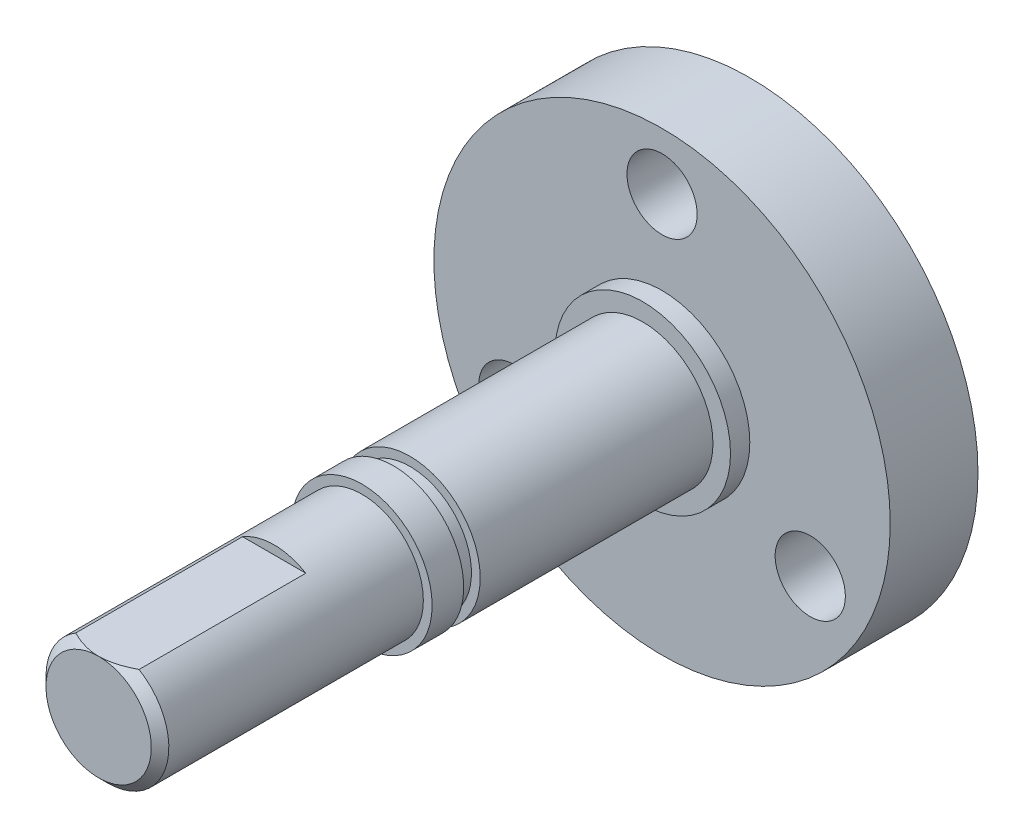
ISO-10303-21;
HEADER;
FILE_DESCRIPTION(('STEP AP214'),'2;1');
FILE_NAME('part.step','',(''),(''),'','','');
FILE_SCHEMA(('AUTOMOTIVE_DESIGN { 1 0 10303 214 1 1 1 1 }'));
ENDSEC;
DATA;
#1=APPLICATION_CONTEXT('core data for automotive mechanical design processes');
#2=APPLICATION_PROTOCOL_DEFINITION('international standard','automotive_design',2000,#1);
#3=PRODUCT_CONTEXT('',#1,'mechanical');
#4=PRODUCT('Part','Part','',(#3));
#5=PRODUCT_RELATED_PRODUCT_CATEGORY('part','',(#4));
#6=PRODUCT_DEFINITION_FORMATION('','',#4);
#7=PRODUCT_DEFINITION_CONTEXT('part definition',#1,'design');
#8=PRODUCT_DEFINITION('design','',#6,#7);
#9=PRODUCT_DEFINITION_SHAPE('','',#8);
#10=(LENGTH_UNIT() NAMED_UNIT(*) SI_UNIT(.MILLI.,.METRE.));
#11=(NAMED_UNIT(*) PLANE_ANGLE_UNIT() SI_UNIT($,.RADIAN.));
#12=(NAMED_UNIT(*) SI_UNIT($,.STERADIAN.) SOLID_ANGLE_UNIT());
#13=UNCERTAINTY_MEASURE_WITH_UNIT(LENGTH_MEASURE(1.E-05),#10,'distance_accuracy_value','');
#14=(GEOMETRIC_REPRESENTATION_CONTEXT(3) GLOBAL_UNCERTAINTY_ASSIGNED_CONTEXT((#13)) GLOBAL_UNIT_ASSIGNED_CONTEXT((#10,
#11,#12)) REPRESENTATION_CONTEXT('',''));
#15=CARTESIAN_POINT('',(0.,0.,0.));
#16=DIRECTION('',(0.,0.,1.));
#17=DIRECTION('',(1.,0.,0.));
#18=AXIS2_PLACEMENT_3D('',#15,#16,#17);
#19=CARTESIAN_POINT('',(0.,0.,22.1));
#20=DIRECTION('',(0.,0.,-1.));
#21=DIRECTION('',(-1.,0.,0.));
#22=AXIS2_PLACEMENT_3D('',#19,#20,#21);
#23=CYLINDRICAL_SURFACE('',#22,4.);
#24=CARTESIAN_POINT('',(0.,0.,6.1));
#25=DIRECTION('',(0.,0.,1.));
#26=DIRECTION('',(1.,0.,0.));
#27=AXIS2_PLACEMENT_3D('',#24,#25,#26);
#28=CIRCLE('',#27,4.);
#29=CARTESIAN_POINT('',(4.,0.,6.1));
#30=VERTEX_POINT('',#29);
#31=EDGE_CURVE('E114',#30,#30,#28,.T.);
#32=ORIENTED_EDGE('',*,*,#31,.T.);
#33=EDGE_LOOP('',(#32));
#34=FACE_BOUND('',#33,.T.);
#35=CARTESIAN_POINT('',(0.,0.,19.36));
#36=DIRECTION('',(0.,0.,1.));
#37=DIRECTION('',(1.,0.,0.));
#38=AXIS2_PLACEMENT_3D('',#35,#36,#37);
#39=CIRCLE('',#38,4.);
#40=CARTESIAN_POINT('',(4.,0.,19.36));
#41=VERTEX_POINT('',#40);
#42=EDGE_CURVE('E91',#41,#41,#39,.T.);
#43=ORIENTED_EDGE('',*,*,#42,.F.);
#44=EDGE_LOOP('',(#43));
#45=FACE_BOUND('',#44,.T.);
#46=ADVANCED_FACE('F33',(#34,#45),#23,.T.);
#47=CARTESIAN_POINT('',(0.,0.,6.1));
#48=DIRECTION('',(0.,0.,1.));
#49=DIRECTION('',(1.,0.,0.));
#50=AXIS2_PLACEMENT_3D('',#47,#48,#49);
#51=PLANE('',#50);
#52=CARTESIAN_POINT('',(0.,0.,6.1));
#53=DIRECTION('',(0.,0.,1.));
#54=DIRECTION('',(1.,0.,0.));
#55=AXIS2_PLACEMENT_3D('',#52,#53,#54);
#56=CIRCLE('',#55,5.);
#57=CARTESIAN_POINT('',(5.,0.,6.1));
#58=VERTEX_POINT('',#57);
#59=EDGE_CURVE('E123',#58,#58,#56,.T.);
#60=ORIENTED_EDGE('',*,*,#59,.T.);
#61=EDGE_LOOP('',(#60));
#62=FACE_BOUND('',#61,.T.);
#63=ORIENTED_EDGE('',*,*,#31,.F.);
#64=EDGE_LOOP('',(#63));
#65=FACE_BOUND('',#64,.T.);
#66=ADVANCED_FACE('F155',(#62,#65),#51,.T.);
#67=CARTESIAN_POINT('',(0.,0.,5.));
#68=DIRECTION('',(0.,0.,1.));
#69=DIRECTION('',(1.,0.,0.));
#70=AXIS2_PLACEMENT_3D('',#67,#68,#69);
#71=PLANE('',#70);
#72=CARTESIAN_POINT('',(-8.44374768689832,-4.87499999999992,5.));
#73=DIRECTION('',(0.,0.,1.));
#74=DIRECTION('',(-0.499999999999992,0.866025403784443,0.));
#75=AXIS2_PLACEMENT_3D('',#72,#73,#74);
#76=CIRCLE('',#75,2.);
#77=CARTESIAN_POINT('',(-9.4437476868983,-3.14294919243104,5.));
#78=VERTEX_POINT('',#77);
#79=EDGE_CURVE('E92',#78,#78,#76,.T.);
#80=ORIENTED_EDGE('',*,*,#79,.F.);
#81=EDGE_LOOP('',(#80));
#82=FACE_BOUND('',#81,.T.);
#83=CARTESIAN_POINT('',(8.44374768689825,-4.87500000000004,5.));
#84=DIRECTION('',(0.,0.,1.));
#85=DIRECTION('',(-0.500000000000004,-0.866025403784436,0.));
#86=AXIS2_PLACEMENT_3D('',#83,#84,#85);
#87=CIRCLE('',#86,2.);
#88=CARTESIAN_POINT('',(7.44374768689825,-6.60705080756891,5.));
#89=VERTEX_POINT('',#88);
#90=EDGE_CURVE('E99',#89,#89,#87,.T.);
#91=ORIENTED_EDGE('',*,*,#90,.F.);
#92=EDGE_LOOP('',(#91));
#93=FACE_BOUND('',#92,.T.);
#94=CARTESIAN_POINT('',(0.,9.75,5.));
#95=DIRECTION('',(0.,0.,1.));
#96=DIRECTION('',(1.,0.,0.));
#97=AXIS2_PLACEMENT_3D('',#94,#95,#96);
#98=CIRCLE('',#97,2.);
#99=CARTESIAN_POINT('',(2.,9.75,5.));
#100=VERTEX_POINT('',#99);
#101=EDGE_CURVE('E105',#100,#100,#98,.T.);
#102=ORIENTED_EDGE('',*,*,#101,.F.);
#103=EDGE_LOOP('',(#102));
#104=FACE_BOUND('',#103,.T.);
#105=CARTESIAN_POINT('',(0.,0.,5.));
#106=DIRECTION('',(0.,0.,1.));
#107=DIRECTION('',(1.,0.,0.));
#108=AXIS2_PLACEMENT_3D('',#105,#106,#107);
#109=CIRCLE('',#108,13.);
#110=CARTESIAN_POINT('',(13.,0.,5.));
#111=VERTEX_POINT('',#110);
#112=EDGE_CURVE('E129',#111,#111,#109,.T.);
#113=ORIENTED_EDGE('',*,*,#112,.T.);
#114=EDGE_LOOP('',(#113));
#115=FACE_BOUND('',#114,.T.);
#116=CARTESIAN_POINT('',(0.,0.,5.));
#117=DIRECTION('',(0.,0.,1.));
#118=DIRECTION('',(1.,0.,0.));
#119=AXIS2_PLACEMENT_3D('',#116,#117,#118);
#120=CIRCLE('',#119,5.);
#121=CARTESIAN_POINT('',(5.,0.,5.));
#122=VERTEX_POINT('',#121);
#123=EDGE_CURVE('E120',#122,#122,#120,.T.);
#124=ORIENTED_EDGE('',*,*,#123,.F.);
#125=EDGE_LOOP('',(#124));
#126=FACE_BOUND('',#125,.T.);
#127=ADVANCED_FACE('F160',(#82,#93,#104,#115,#126),#71,.T.);
#128=CARTESIAN_POINT('',(0.,0.,5.));
#129=DIRECTION('',(0.,0.,-1.));
#130=DIRECTION('',(-1.,0.,0.));
#131=AXIS2_PLACEMENT_3D('',#128,#129,#130);
#132=CYLINDRICAL_SURFACE('',#131,13.);
#133=ORIENTED_EDGE('',*,*,#112,.F.);
#134=EDGE_LOOP('',(#133));
#135=FACE_BOUND('',#134,.T.);
#136=CARTESIAN_POINT('',(0.,0.,0.));
#137=DIRECTION('',(0.,0.,1.));
#138=DIRECTION('',(1.,0.,0.));
#139=AXIS2_PLACEMENT_3D('',#136,#137,#138);
#140=CIRCLE('',#139,13.);
#141=CARTESIAN_POINT('',(13.,0.,0.));
#142=VERTEX_POINT('',#141);
#143=EDGE_CURVE('E126',#142,#142,#140,.T.);
#144=ORIENTED_EDGE('',*,*,#143,.T.);
#145=EDGE_LOOP('',(#144));
#146=FACE_BOUND('',#145,.T.);
#147=ADVANCED_FACE('F35',(#135,#146),#132,.T.);
#148=CARTESIAN_POINT('',(0.,0.,0.));
#149=DIRECTION('',(0.,0.,1.));
#150=DIRECTION('',(1.,0.,0.));
#151=AXIS2_PLACEMENT_3D('',#148,#149,#150);
#152=PLANE('',#151);
#153=CARTESIAN_POINT('',(0.,0.,0.));
#154=DIRECTION('',(0.,0.,-1.));
#155=DIRECTION('',(-1.,0.,0.));
#156=AXIS2_PLACEMENT_3D('',#153,#154,#155);
#157=CIRCLE('',#156,6.);
#158=CARTESIAN_POINT('',(-6.,0.,0.));
#159=VERTEX_POINT('',#158);
#160=EDGE_CURVE('E313',#159,#159,#157,.T.);
#161=ORIENTED_EDGE('',*,*,#160,.F.);
#162=EDGE_LOOP('',(#161));
#163=FACE_BOUND('',#162,.T.);
#164=CARTESIAN_POINT('',(-8.44374768689832,-4.87499999999992,0.));
#165=DIRECTION('',(0.,0.,1.));
#166=DIRECTION('',(-0.499999999999992,0.866025403784443,0.));
#167=AXIS2_PLACEMENT_3D('',#164,#165,#166);
#168=CIRCLE('',#167,2.);
#169=CARTESIAN_POINT('',(-9.4437476868983,-3.14294919243104,0.));
#170=VERTEX_POINT('',#169);
#171=EDGE_CURVE('E95',#170,#170,#168,.T.);
#172=ORIENTED_EDGE('',*,*,#171,.T.);
#173=EDGE_LOOP('',(#172));
#174=FACE_BOUND('',#173,.T.);
#175=CARTESIAN_POINT('',(8.44374768689825,-4.87500000000004,0.));
#176=DIRECTION('',(0.,0.,1.));
#177=DIRECTION('',(-0.500000000000004,-0.866025403784436,0.));
#178=AXIS2_PLACEMENT_3D('',#175,#176,#177);
#179=CIRCLE('',#178,2.);
#180=CARTESIAN_POINT('',(7.44374768689825,-6.60705080756891,0.));
#181=VERTEX_POINT('',#180);
#182=EDGE_CURVE('E102',#181,#181,#179,.T.);
#183=ORIENTED_EDGE('',*,*,#182,.T.);
#184=EDGE_LOOP('',(#183));
#185=FACE_BOUND('',#184,.T.);
#186=CARTESIAN_POINT('',(0.,9.75,0.));
#187=DIRECTION('',(0.,0.,1.));
#188=DIRECTION('',(1.,0.,0.));
#189=AXIS2_PLACEMENT_3D('',#186,#187,#188);
#190=CIRCLE('',#189,2.);
#191=CARTESIAN_POINT('',(2.,9.75,0.));
#192=VERTEX_POINT('',#191);
#193=EDGE_CURVE('E108',#192,#192,#190,.T.);
#194=ORIENTED_EDGE('',*,*,#193,.T.);
#195=EDGE_LOOP('',(#194));
#196=FACE_BOUND('',#195,.T.);
#197=ORIENTED_EDGE('',*,*,#143,.F.);
#198=EDGE_LOOP('',(#197));
#199=FACE_BOUND('',#198,.T.);
#200=ADVANCED_FACE('F171',(#163,#174,#185,#196,#199),#152,.F.);
#201=CARTESIAN_POINT('',(0.,0.,6.1));
#202=DIRECTION('',(0.,0.,-1.));
#203=DIRECTION('',(-1.,0.,0.));
#204=AXIS2_PLACEMENT_3D('',#201,#202,#203);
#205=CYLINDRICAL_SURFACE('',#204,5.);
#206=ORIENTED_EDGE('',*,*,#59,.F.);
#207=EDGE_LOOP('',(#206));
#208=FACE_BOUND('',#207,.T.);
#209=ORIENTED_EDGE('',*,*,#123,.T.);
#210=EDGE_LOOP('',(#209));
#211=FACE_BOUND('',#210,.T.);
#212=ADVANCED_FACE('F167',(#208,#211),#205,.T.);
#213=CARTESIAN_POINT('',(0.,9.75,0.));
#214=DIRECTION('',(0.,0.,1.));
#215=DIRECTION('',(1.,0.,0.));
#216=AXIS2_PLACEMENT_3D('',#213,#214,#215);
#217=CYLINDRICAL_SURFACE('',#216,2.);
#218=ORIENTED_EDGE('',*,*,#193,.F.);
#219=EDGE_LOOP('',(#218));
#220=FACE_BOUND('',#219,.T.);
#221=ORIENTED_EDGE('',*,*,#101,.T.);
#222=EDGE_LOOP('',(#221));
#223=FACE_BOUND('',#222,.T.);
#224=ADVANCED_FACE('F170',(#220,#223),#217,.F.);
#225=CARTESIAN_POINT('',(8.44374768689825,-4.87500000000004,0.));
#226=DIRECTION('',(0.,0.,1.));
#227=DIRECTION('',(1.,0.,0.));
#228=AXIS2_PLACEMENT_3D('',#225,#226,#227);
#229=CYLINDRICAL_SURFACE('',#228,2.);
#230=ORIENTED_EDGE('',*,*,#182,.F.);
#231=EDGE_LOOP('',(#230));
#232=FACE_BOUND('',#231,.T.);
#233=ORIENTED_EDGE('',*,*,#90,.T.);
#234=EDGE_LOOP('',(#233));
#235=FACE_BOUND('',#234,.T.);
#236=ADVANCED_FACE('F196',(#232,#235),#229,.F.);
#237=CARTESIAN_POINT('',(-8.44374768689832,-4.87499999999992,0.));
#238=DIRECTION('',(0.,0.,1.));
#239=DIRECTION('',(1.,0.,0.));
#240=AXIS2_PLACEMENT_3D('',#237,#238,#239);
#241=CYLINDRICAL_SURFACE('',#240,2.);
#242=ORIENTED_EDGE('',*,*,#171,.F.);
#243=EDGE_LOOP('',(#242));
#244=FACE_BOUND('',#243,.T.);
#245=ORIENTED_EDGE('',*,*,#79,.T.);
#246=EDGE_LOOP('',(#245));
#247=FACE_BOUND('',#246,.T.);
#248=ADVANCED_FACE('F202',(#244,#247),#241,.F.);
#249=CARTESIAN_POINT('',(3.5,0.,20.3));
#250=DIRECTION('',(0.,0.,-1.));
#251=DIRECTION('',(-1.,0.,0.));
#252=AXIS2_PLACEMENT_3D('',#249,#250,#251);
#253=PLANE('',#252);
#254=CARTESIAN_POINT('',(0.,0.,20.3));
#255=DIRECTION('',(0.,0.,-1.));
#256=DIRECTION('',(-1.,0.,0.));
#257=AXIS2_PLACEMENT_3D('',#254,#255,#256);
#258=CIRCLE('',#257,3.5);
#259=CARTESIAN_POINT('',(-3.5,0.,20.3));
#260=VERTEX_POINT('',#259);
#261=EDGE_CURVE('E88',#260,#260,#258,.T.);
#262=ORIENTED_EDGE('',*,*,#261,.F.);
#263=EDGE_LOOP('',(#262));
#264=FACE_BOUND('',#263,.T.);
#265=CARTESIAN_POINT('',(0.,0.,20.3));
#266=DIRECTION('',(0.,0.,-1.));
#267=DIRECTION('',(-1.,0.,0.));
#268=AXIS2_PLACEMENT_3D('',#265,#266,#267);
#269=CIRCLE('',#268,4.);
#270=CARTESIAN_POINT('',(-4.,0.,20.3));
#271=VERTEX_POINT('',#270);
#272=EDGE_CURVE('E96',#271,#271,#269,.T.);
#273=ORIENTED_EDGE('',*,*,#272,.T.);
#274=EDGE_LOOP('',(#273));
#275=FACE_BOUND('',#274,.T.);
#276=ADVANCED_FACE('F223',(#264,#275),#253,.T.);
#277=CARTESIAN_POINT('',(3.5,0.,19.36));
#278=DIRECTION('',(0.,0.,1.));
#279=DIRECTION('',(1.,0.,0.));
#280=AXIS2_PLACEMENT_3D('',#277,#278,#279);
#281=PLANE('',#280);
#282=CARTESIAN_POINT('',(0.,0.,19.36));
#283=DIRECTION('',(0.,0.,-1.));
#284=DIRECTION('',(-1.,0.,0.));
#285=AXIS2_PLACEMENT_3D('',#282,#283,#284);
#286=CIRCLE('',#285,3.5);
#287=CARTESIAN_POINT('',(-3.5,0.,19.36));
#288=VERTEX_POINT('',#287);
#289=EDGE_CURVE('E83',#288,#288,#286,.T.);
#290=ORIENTED_EDGE('',*,*,#289,.T.);
#291=EDGE_LOOP('',(#290));
#292=FACE_BOUND('',#291,.T.);
#293=ORIENTED_EDGE('',*,*,#42,.T.);
#294=EDGE_LOOP('',(#293));
#295=FACE_BOUND('',#294,.T.);
#296=ADVANCED_FACE('F225',(#292,#295),#281,.T.);
#297=CARTESIAN_POINT('',(0.,0.,28.7718328466138));
#298=DIRECTION('',(0.,0.,-1.));
#299=DIRECTION('',(-1.,0.,0.));
#300=AXIS2_PLACEMENT_3D('',#297,#298,#299);
#301=CYLINDRICAL_SURFACE('',#300,3.5);
#302=ORIENTED_EDGE('',*,*,#261,.T.);
#303=EDGE_LOOP('',(#302));
#304=FACE_BOUND('',#303,.T.);
#305=ORIENTED_EDGE('',*,*,#289,.F.);
#306=EDGE_LOOP('',(#305));
#307=FACE_BOUND('',#306,.T.);
#308=ADVANCED_FACE('F209',(#304,#307),#301,.T.);
#309=CARTESIAN_POINT('',(0.,0.,37.1));
#310=DIRECTION('',(0.,0.,1.));
#311=DIRECTION('',(1.,0.,0.));
#312=AXIS2_PLACEMENT_3D('',#309,#310,#311);
#313=PLANE('',#312);
#314=CARTESIAN_POINT('',(0.,0.,37.1));
#315=DIRECTION('',(0.,0.,1.));
#316=DIRECTION('',(1.,0.,0.));
#317=AXIS2_PLACEMENT_3D('',#314,#315,#316);
#318=CIRCLE('',#317,2.99999999999999);
#319=CARTESIAN_POINT('',(0.,2.99999999999999,37.1));
#320=VERTEX_POINT('',#319);
#321=EDGE_CURVE('E132',#320,#320,#318,.T.);
#322=ORIENTED_EDGE('',*,*,#321,.T.);
#323=EDGE_LOOP('',(#322));
#324=FACE_BOUND('',#323,.T.);
#325=ADVANCED_FACE('F140',(#324),#313,.T.);
#326=CARTESIAN_POINT('',(0.,0.,37.1));
#327=DIRECTION('',(0.,0.,-1.));
#328=DIRECTION('',(-1.,0.,0.));
#329=AXIS2_PLACEMENT_3D('',#326,#327,#328);
#330=CYLINDRICAL_SURFACE('',#329,3.5);
#331=CARTESIAN_POINT('',(0.,0.,36.6));
#332=DIRECTION('',(0.,0.,1.));
#333=DIRECTION('',(1.,0.,0.));
#334=AXIS2_PLACEMENT_3D('',#331,#332,#333);
#335=CIRCLE('',#334,3.5);
#336=CARTESIAN_POINT('',(1.80277563773199,3.,36.6));
#337=VERTEX_POINT('',#336);
#338=CARTESIAN_POINT('',(-1.80277563773199,3.,36.6));
#339=VERTEX_POINT('',#338);
#340=EDGE_CURVE('E81',#337,#339,#335,.F.);
#341=ORIENTED_EDGE('',*,*,#340,.T.);
#342=DIRECTION('',(0.,0.,1.));
#343=VECTOR('',#342,1.);
#344=CARTESIAN_POINT('',(-1.80277563773199,3.,27.1));
#345=LINE('',#344,#343);
#346=CARTESIAN_POINT('',(-1.80277563773199,3.,27.1));
#347=VERTEX_POINT('',#346);
#348=EDGE_CURVE('E74',#347,#339,#345,.T.);
#349=ORIENTED_EDGE('',*,*,#348,.F.);
#350=CARTESIAN_POINT('',(0.,0.,27.1));
#351=DIRECTION('',(0.,0.,1.));
#352=DIRECTION('',(1.,0.,0.));
#353=AXIS2_PLACEMENT_3D('',#350,#351,#352);
#354=CIRCLE('',#353,3.5);
#355=CARTESIAN_POINT('',(1.80277563773199,3.,27.1));
#356=VERTEX_POINT('',#355);
#357=EDGE_CURVE('E65',#356,#347,#354,.T.);
#358=ORIENTED_EDGE('',*,*,#357,.F.);
#359=DIRECTION('',(0.,0.,1.));
#360=VECTOR('',#359,1.);
#361=CARTESIAN_POINT('',(1.80277563773199,3.,27.1));
#362=LINE('',#361,#360);
#363=EDGE_CURVE('E75',#356,#337,#362,.T.);
#364=ORIENTED_EDGE('',*,*,#363,.T.);
#365=EDGE_LOOP('',(#341,#349,#358,#364));
#366=FACE_BOUND('',#365,.T.);
#367=CARTESIAN_POINT('',(0.,0.,22.1));
#368=DIRECTION('',(0.,0.,1.));
#369=DIRECTION('',(1.,0.,0.));
#370=AXIS2_PLACEMENT_3D('',#367,#368,#369);
#371=CIRCLE('',#370,3.5);
#372=CARTESIAN_POINT('',(3.5,0.,22.1));
#373=VERTEX_POINT('',#372);
#374=EDGE_CURVE('E111',#373,#373,#371,.T.);
#375=ORIENTED_EDGE('',*,*,#374,.T.);
#376=EDGE_LOOP('',(#375));
#377=FACE_BOUND('',#376,.T.);
#378=ADVANCED_FACE('F78',(#366,#377),#330,.T.);
#379=CARTESIAN_POINT('',(0.,0.,22.1));
#380=DIRECTION('',(0.,0.,1.));
#381=DIRECTION('',(1.,0.,0.));
#382=AXIS2_PLACEMENT_3D('',#379,#380,#381);
#383=PLANE('',#382);
#384=CARTESIAN_POINT('',(0.,0.,22.1));
#385=DIRECTION('',(0.,0.,1.));
#386=DIRECTION('',(1.,0.,0.));
#387=AXIS2_PLACEMENT_3D('',#384,#385,#386);
#388=CIRCLE('',#387,4.);
#389=CARTESIAN_POINT('',(4.,0.,22.1));
#390=VERTEX_POINT('',#389);
#391=EDGE_CURVE('E117',#390,#390,#388,.T.);
#392=ORIENTED_EDGE('',*,*,#391,.T.);
#393=EDGE_LOOP('',(#392));
#394=FACE_BOUND('',#393,.T.);
#395=ORIENTED_EDGE('',*,*,#374,.F.);
#396=EDGE_LOOP('',(#395));
#397=FACE_BOUND('',#396,.T.);
#398=ADVANCED_FACE('F149',(#394,#397),#383,.T.);
#399=ORIENTED_EDGE('',*,*,#391,.F.);
#400=EDGE_LOOP('',(#399));
#401=FACE_BOUND('',#400,.T.);
#402=ORIENTED_EDGE('',*,*,#272,.F.);
#403=EDGE_LOOP('',(#402));
#404=FACE_BOUND('',#403,.T.);
#405=ADVANCED_FACE('F144',(#401,#404),#23,.T.);
#406=CARTESIAN_POINT('',(0.,0.,37.1));
#407=DIRECTION('',(0.,0.,-1.));
#408=DIRECTION('',(-1.,0.,0.));
#409=AXIS2_PLACEMENT_3D('',#406,#407,#408);
#410=CONICAL_SURFACE('',#409,2.99999999999999,0.785398163397457);
#411=CARTESIAN_POINT('',(-4.22958461642272,3.,34.9145023356018));
#412=CARTESIAN_POINT('',(-4.12307120592173,3.,35.0013584854783));
#413=CARTESIAN_POINT('',(-4.01603582677054,3.,35.0875847477115));
#414=CARTESIAN_POINT('',(-3.80065873371535,3.,35.2584458081577));
#415=CARTESIAN_POINT('',(-3.69231669067207,3.,35.3430801910405));
#416=CARTESIAN_POINT('',(-3.47292699917331,3.,35.5112942656889));
#417=CARTESIAN_POINT('',(-3.36186272459781,3.,35.5948523452508));
#418=CARTESIAN_POINT('',(-3.13788169504469,3.,35.7594324479847));
#419=CARTESIAN_POINT('',(-3.02496511733502,3.,35.8404547117046));
#420=CARTESIAN_POINT('',(-2.78662317914647,3.,36.0064319514841));
#421=CARTESIAN_POINT('',(-2.66098635631262,3.,36.0910849950405));
#422=CARTESIAN_POINT('',(-2.40638580637319,3.,36.2553641756846));
#423=CARTESIAN_POINT('',(-2.27742104610431,3.,36.3349887245654));
#424=CARTESIAN_POINT('',(-2.01608182127992,3.,36.4870598856104));
#425=CARTESIAN_POINT('',(-1.88372571218742,3.,36.5595377499512));
#426=CARTESIAN_POINT('',(-1.61437615917291,3.,36.6951964753804));
#427=CARTESIAN_POINT('',(-1.47738674365081,3.,36.7583851696466));
#428=CARTESIAN_POINT('',(-1.23706866848832,3.,36.8562528246922));
#429=CARTESIAN_POINT('',(-1.13498684568301,3.,36.8939712922816));
#430=CARTESIAN_POINT('',(-0.928104936687981,3.,36.9612396901271));
#431=CARTESIAN_POINT('',(-0.823304478282008,3.,36.9907884953256));
#432=CARTESIAN_POINT('',(-0.613690038469461,3.,37.039531803344));
#433=CARTESIAN_POINT('',(-0.508926098075245,3.,37.0589378701108));
#434=CARTESIAN_POINT('',(-0.297962917798545,3.,37.0870494212723));
#435=CARTESIAN_POINT('',(-0.191764009575053,3.,37.0957573369266));
#436=CARTESIAN_POINT('',(0.0157051724843443,3.,37.1016624225921));
#437=CARTESIAN_POINT('',(0.116959906526611,3.,37.0994066871663));
#438=CARTESIAN_POINT('',(0.318730936525237,3.,37.0847952352846));
#439=CARTESIAN_POINT('',(0.419247177274713,3.,37.0724387713352));
#440=CARTESIAN_POINT('',(0.620569062237244,3.,37.0381266210584));
#441=CARTESIAN_POINT('',(0.721343871661819,3.,37.0159928884521));
#442=CARTESIAN_POINT('',(0.920642196548553,3.,36.9633867050116));
#443=CARTESIAN_POINT('',(1.01916577678233,3.,36.9329144944174));
#444=CARTESIAN_POINT('',(1.31776718454363,3.,36.8287897328723));
#445=CARTESIAN_POINT('',(1.51389628709606,3.,36.7437840103025));
#446=CARTESIAN_POINT('',(1.80096406186259,3.,36.6019206918866));
#447=CARTESIAN_POINT('',(1.89563931155905,3.,36.5521317613496));
#448=CARTESIAN_POINT('',(2.08285116461217,3.,36.4486747789094));
#449=CARTESIAN_POINT('',(2.17538813512383,3.,36.3950073995895));
#450=CARTESIAN_POINT('',(2.35403939770459,3.,36.2873001121127));
#451=CARTESIAN_POINT('',(2.44024497811185,3.,36.2334099255339));
#452=CARTESIAN_POINT('',(2.61117680301806,3.,36.123321494966));
#453=CARTESIAN_POINT('',(2.69590293686264,3.,36.0671230793791));
#454=CARTESIAN_POINT('',(2.86339013519467,3.,35.9532840620872));
#455=CARTESIAN_POINT('',(2.94616147834213,3.,35.8956585203384));
#456=CARTESIAN_POINT('',(3.11056682514326,3.,35.7788527712405));
#457=CARTESIAN_POINT('',(3.19220113594641,3.,35.7196729967134));
#458=CARTESIAN_POINT('',(3.27335828097903,3.,35.6598564847909));
#459=B_SPLINE_CURVE_WITH_KNOTS('',3,(#411,#412,#413,#414,#415,#416,#417,#418,#419,#420,#421,
#422,#423,#424,#425,#426,#427,#428,#429,#430,#431,#432,#433,#434,#435,#436,#437,#438,#439,#440,
#441,#442,#443,#444,#445,#446,#447,#448,#449,#450,#451,#452,#453,#454,#455,#456,#457,#458),
.UNSPECIFIED.,.F.,.F.,(4,2,2,2,2,2,2,2,2,2,2,2,2,2,2,2,2,2,2,2,2,2,2,4),(0.,0.412319998970126,
0.824746122619541,1.2416763133118,1.65856683333362,2.11296169395484,2.56749936084167,
3.01995189941286,3.47202068730272,3.79822914444449,4.12448250193725,4.44362774903167,
4.76270045381789,5.06601952968907,5.36936105439034,5.67847011295746,5.98757026671466,
6.62687537490371,6.94775368437191,7.26857648147899,7.5735308046538,7.87850783985047,
8.18105473522876,8.48351825265815),.UNSPECIFIED.);
#460=EDGE_CURVE('E11',#339,#320,#459,.T.);
#461=ORIENTED_EDGE('',*,*,#460,.F.);
#462=ORIENTED_EDGE('',*,*,#340,.F.);
#463=EDGE_CURVE('E37',#320,#337,#459,.T.);
#464=ORIENTED_EDGE('',*,*,#463,.F.);
#465=ORIENTED_EDGE('',*,*,#321,.F.);
#466=EDGE_LOOP('',(#461,#462,#464,#465));
#467=FACE_BOUND('',#466,.T.);
#468=ADVANCED_FACE('F142',(#467),#410,.T.);
#469=CARTESIAN_POINT('',(-1.80277563773199,3.,27.1));
#470=DIRECTION('',(0.,-1.,0.));
#471=DIRECTION('',(0.,0.,-1.));
#472=AXIS2_PLACEMENT_3D('',#469,#470,#471);
#473=PLANE('',#472);
#474=ORIENTED_EDGE('',*,*,#460,.T.);
#475=ORIENTED_EDGE('',*,*,#463,.T.);
#476=ORIENTED_EDGE('',*,*,#363,.F.);
#477=DIRECTION('',(1.,0.,0.));
#478=VECTOR('',#477,1.);
#479=CARTESIAN_POINT('',(-1.80277563773199,3.,27.1));
#480=LINE('',#479,#478);
#481=EDGE_CURVE('E68',#347,#356,#480,.T.);
#482=ORIENTED_EDGE('',*,*,#481,.F.);
#483=ORIENTED_EDGE('',*,*,#348,.T.);
#484=EDGE_LOOP('',(#474,#475,#476,#482,#483));
#485=FACE_BOUND('',#484,.T.);
#486=ADVANCED_FACE('F73',(#485),#473,.F.);
#487=CARTESIAN_POINT('',(0.,0.,27.1));
#488=DIRECTION('',(0.,0.,1.));
#489=DIRECTION('',(1.,0.,0.));
#490=AXIS2_PLACEMENT_3D('',#487,#488,#489);
#491=PLANE('',#490);
#492=ORIENTED_EDGE('',*,*,#357,.T.);
#493=ORIENTED_EDGE('',*,*,#481,.T.);
#494=EDGE_LOOP('',(#492,#493));
#495=FACE_BOUND('',#494,.T.);
#496=ADVANCED_FACE('F67',(#495),#491,.T.);
#497=CARTESIAN_POINT('',(0.,0.,1.));
#498=DIRECTION('',(0.,0.,-1.));
#499=DIRECTION('',(-1.,0.,0.));
#500=AXIS2_PLACEMENT_3D('',#497,#498,#499);
#501=CYLINDRICAL_SURFACE('',#500,6.);
#502=CARTESIAN_POINT('',(0.,0.,1.));
#503=DIRECTION('',(0.,0.,-1.));
#504=DIRECTION('',(-1.,0.,0.));
#505=AXIS2_PLACEMENT_3D('',#502,#503,#504);
#506=CIRCLE('',#505,6.);
#507=CARTESIAN_POINT('',(-6.,0.,1.));
#508=VERTEX_POINT('',#507);
#509=EDGE_CURVE('E71',#508,#508,#506,.T.);
#510=ORIENTED_EDGE('',*,*,#509,.F.);
#511=EDGE_LOOP('',(#510));
#512=FACE_BOUND('',#511,.T.);
#513=ORIENTED_EDGE('',*,*,#160,.T.);
#514=EDGE_LOOP('',(#513));
#515=FACE_BOUND('',#514,.T.);
#516=ADVANCED_FACE('F287',(#512,#515),#501,.F.);
#517=CARTESIAN_POINT('',(0.,0.,1.));
#518=DIRECTION('',(0.,0.,-1.));
#519=DIRECTION('',(-1.,0.,0.));
#520=AXIS2_PLACEMENT_3D('',#517,#518,#519);
#521=PLANE('',#520);
#522=ORIENTED_EDGE('',*,*,#509,.T.);
#523=EDGE_LOOP('',(#522));
#524=FACE_BOUND('',#523,.T.);
#525=ADVANCED_FACE('F296',(#524),#521,.T.);
#526=CLOSED_SHELL('',(#46,#66,#127,#147,#200,#212,#224,#236,#248,#276,#296,#308,#325,#378,#398,
#405,#468,#486,#496,#516,#525));
#527=MANIFOLD_SOLID_BREP('B2',#526);
#528=ADVANCED_BREP_SHAPE_REPRESENTATION('',(#18,#527),#14);
#529=SHAPE_DEFINITION_REPRESENTATION(#9,#528);
ENDSEC;
END-ISO-10303-21;
